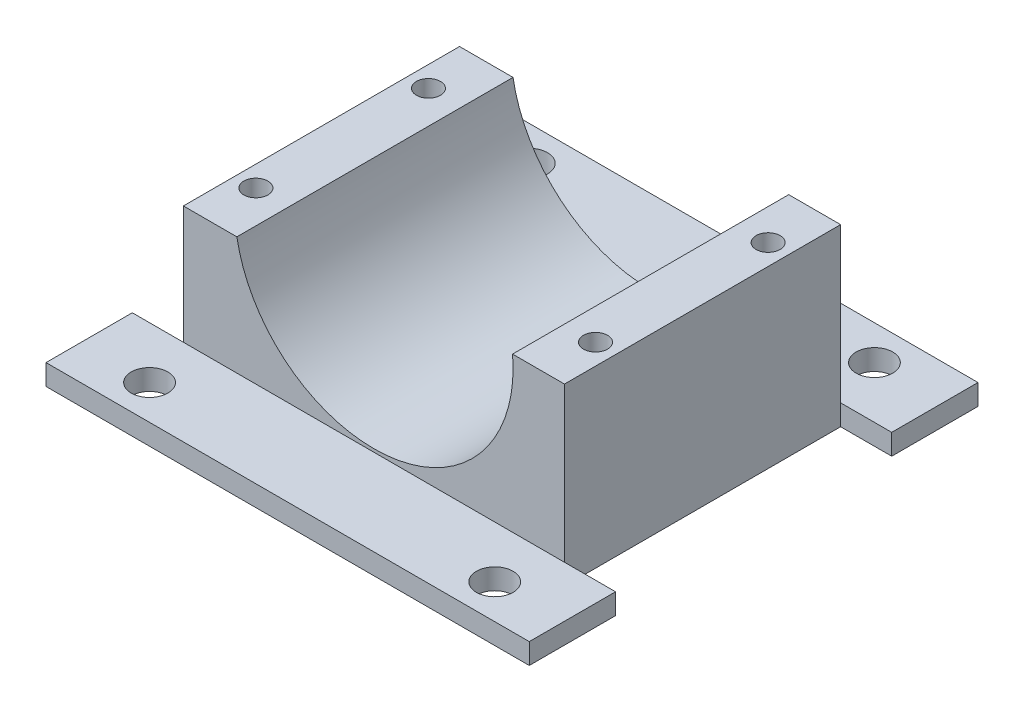
ISO-10303-21;
HEADER;
FILE_DESCRIPTION(('STEP AP214'),'2;1');
FILE_NAME('part.step','',(''),(''),'','','');
FILE_SCHEMA(('AUTOMOTIVE_DESIGN { 1 0 10303 214 1 1 1 1 }'));
ENDSEC;
DATA;
#1=APPLICATION_CONTEXT('core data for automotive mechanical design processes');
#2=APPLICATION_PROTOCOL_DEFINITION('international standard','automotive_design',2000,#1);
#3=PRODUCT_CONTEXT('',#1,'mechanical');
#4=PRODUCT('Part','Part','',(#3));
#5=PRODUCT_RELATED_PRODUCT_CATEGORY('part','',(#4));
#6=PRODUCT_DEFINITION_FORMATION('','',#4);
#7=PRODUCT_DEFINITION_CONTEXT('part definition',#1,'design');
#8=PRODUCT_DEFINITION('design','',#6,#7);
#9=PRODUCT_DEFINITION_SHAPE('','',#8);
#10=(LENGTH_UNIT() NAMED_UNIT(*) SI_UNIT(.MILLI.,.METRE.));
#11=(NAMED_UNIT(*) PLANE_ANGLE_UNIT() SI_UNIT($,.RADIAN.));
#12=(NAMED_UNIT(*) SI_UNIT($,.STERADIAN.) SOLID_ANGLE_UNIT());
#13=UNCERTAINTY_MEASURE_WITH_UNIT(LENGTH_MEASURE(1.E-05),#10,'distance_accuracy_value','');
#14=(GEOMETRIC_REPRESENTATION_CONTEXT(3) GLOBAL_UNCERTAINTY_ASSIGNED_CONTEXT((#13)) GLOBAL_UNIT_ASSIGNED_CONTEXT((#10,
#11,#12)) REPRESENTATION_CONTEXT('',''));
#15=CARTESIAN_POINT('',(0.,0.,0.));
#16=DIRECTION('',(0.,0.,1.));
#17=DIRECTION('',(1.,0.,0.));
#18=AXIS2_PLACEMENT_3D('',#15,#16,#17);
#19=CARTESIAN_POINT('',(0.,0.,-50.8));
#20=DIRECTION('',(0.,0.,1.));
#21=DIRECTION('',(1.,0.,0.));
#22=AXIS2_PLACEMENT_3D('',#19,#20,#21);
#23=PLANE('',#22);
#24=DIRECTION('',(1.,0.,0.));
#25=VECTOR('',#24,1.);
#26=CARTESIAN_POINT('',(-88.9,-52.324,-50.8));
#27=LINE('',#26,#25);
#28=CARTESIAN_POINT('',(-70.104,-52.324,-50.8));
#29=VERTEX_POINT('',#28);
#30=CARTESIAN_POINT('',(70.104,-52.324,-50.8));
#31=VERTEX_POINT('',#30);
#32=EDGE_CURVE('E11',#29,#31,#27,.T.);
#33=ORIENTED_EDGE('',*,*,#32,.F.);
#34=DIRECTION('',(0.,-1.,0.));
#35=VECTOR('',#34,1.);
#36=CARTESIAN_POINT('',(-70.104,0.,-50.8));
#37=LINE('',#36,#35);
#38=CARTESIAN_POINT('',(-70.104,-8.89148128126936,-50.8));
#39=VERTEX_POINT('',#38);
#40=EDGE_CURVE('E285',#39,#29,#37,.T.);
#41=ORIENTED_EDGE('',*,*,#40,.F.);
#42=DIRECTION('',(-1.,0.,0.));
#43=VECTOR('',#42,1.);
#44=CARTESIAN_POINT('',(0.,-8.89148128126934,-50.8));
#45=LINE('',#44,#43);
#46=CARTESIAN_POINT('',(-50.426096139936,-8.89148128126936,-50.8));
#47=VERTEX_POINT('',#46);
#48=EDGE_CURVE('E299',#47,#39,#45,.T.);
#49=ORIENTED_EDGE('',*,*,#48,.F.);
#50=CARTESIAN_POINT('',(0.,0.,-50.8));
#51=DIRECTION('',(0.,0.,1.));
#52=DIRECTION('',(1.,0.,0.));
#53=AXIS2_PLACEMENT_3D('',#50,#51,#52);
#54=CIRCLE('',#53,51.203999954);
#55=CARTESIAN_POINT('',(51.0091532752648,4.46272264764193,-50.8));
#56=VERTEX_POINT('',#55);
#57=EDGE_CURVE('E296',#47,#56,#54,.T.);
#58=ORIENTED_EDGE('',*,*,#57,.T.);
#59=DIRECTION('',(1.,0.,0.));
#60=VECTOR('',#59,1.);
#61=CARTESIAN_POINT('',(0.,4.46272264764193,-50.8));
#62=LINE('',#61,#60);
#63=CARTESIAN_POINT('',(70.104,4.46272264764193,-50.8));
#64=VERTEX_POINT('',#63);
#65=EDGE_CURVE('E293',#56,#64,#62,.T.);
#66=ORIENTED_EDGE('',*,*,#65,.T.);
#67=DIRECTION('',(0.,-1.,0.));
#68=VECTOR('',#67,1.);
#69=CARTESIAN_POINT('',(70.104,0.,-50.8));
#70=LINE('',#69,#68);
#71=EDGE_CURVE('E290',#64,#31,#70,.T.);
#72=ORIENTED_EDGE('',*,*,#71,.T.);
#73=EDGE_LOOP('',(#33,#41,#49,#58,#66,#72));
#74=FACE_BOUND('',#73,.T.);
#75=ADVANCED_FACE('F47',(#74),#23,.F.);
#76=CARTESIAN_POINT('',(0.,0.,50.8));
#77=DIRECTION('',(0.,0.,1.));
#78=DIRECTION('',(1.,0.,0.));
#79=AXIS2_PLACEMENT_3D('',#76,#77,#78);
#80=PLANE('',#79);
#81=DIRECTION('',(0.,-1.,0.));
#82=VECTOR('',#81,1.);
#83=CARTESIAN_POINT('',(-70.104,0.,50.8));
#84=LINE('',#83,#82);
#85=CARTESIAN_POINT('',(-70.104,-8.89148128126936,50.8));
#86=VERTEX_POINT('',#85);
#87=CARTESIAN_POINT('',(-70.104,-52.324,50.8));
#88=VERTEX_POINT('',#87);
#89=EDGE_CURVE('E303',#86,#88,#84,.T.);
#90=ORIENTED_EDGE('',*,*,#89,.T.);
#91=DIRECTION('',(1.,0.,0.));
#92=VECTOR('',#91,1.);
#93=CARTESIAN_POINT('',(-88.9,-52.324,50.8));
#94=LINE('',#93,#92);
#95=CARTESIAN_POINT('',(70.104,-52.324,50.8));
#96=VERTEX_POINT('',#95);
#97=EDGE_CURVE('E57',#88,#96,#94,.T.);
#98=ORIENTED_EDGE('',*,*,#97,.T.);
#99=DIRECTION('',(0.,-1.,0.));
#100=VECTOR('',#99,1.);
#101=CARTESIAN_POINT('',(70.104,0.,50.8));
#102=LINE('',#101,#100);
#103=CARTESIAN_POINT('',(70.104,4.46272264764193,50.8));
#104=VERTEX_POINT('',#103);
#105=EDGE_CURVE('E308',#104,#96,#102,.T.);
#106=ORIENTED_EDGE('',*,*,#105,.F.);
#107=DIRECTION('',(1.,0.,0.));
#108=VECTOR('',#107,1.);
#109=CARTESIAN_POINT('',(0.,4.46272264764193,50.8));
#110=LINE('',#109,#108);
#111=CARTESIAN_POINT('',(51.0091532752648,4.46272264764193,50.8));
#112=VERTEX_POINT('',#111);
#113=EDGE_CURVE('E312',#112,#104,#110,.T.);
#114=ORIENTED_EDGE('',*,*,#113,.F.);
#115=CARTESIAN_POINT('',(0.,0.,50.8));
#116=DIRECTION('',(0.,0.,1.));
#117=DIRECTION('',(1.,0.,0.));
#118=AXIS2_PLACEMENT_3D('',#115,#116,#117);
#119=CIRCLE('',#118,51.203999954);
#120=CARTESIAN_POINT('',(-50.426096139936,-8.89148128126936,50.8));
#121=VERTEX_POINT('',#120);
#122=EDGE_CURVE('E315',#121,#112,#119,.T.);
#123=ORIENTED_EDGE('',*,*,#122,.F.);
#124=DIRECTION('',(-1.,0.,0.));
#125=VECTOR('',#124,1.);
#126=CARTESIAN_POINT('',(0.,-8.89148128126934,50.8));
#127=LINE('',#126,#125);
#128=EDGE_CURVE('E318',#121,#86,#127,.T.);
#129=ORIENTED_EDGE('',*,*,#128,.T.);
#130=EDGE_LOOP('',(#90,#98,#106,#114,#123,#129));
#131=FACE_BOUND('',#130,.T.);
#132=ADVANCED_FACE('F428',(#131),#80,.T.);
#133=CARTESIAN_POINT('',(-70.104,0.,-50.8));
#134=DIRECTION('',(-1.,0.,0.));
#135=DIRECTION('',(0.,0.,1.));
#136=AXIS2_PLACEMENT_3D('',#133,#134,#135);
#137=PLANE('',#136);
#138=ORIENTED_EDGE('',*,*,#89,.F.);
#139=DIRECTION('',(0.,0.,1.));
#140=VECTOR('',#139,1.);
#141=CARTESIAN_POINT('',(-70.104,-8.89148128126936,-50.8));
#142=LINE('',#141,#140);
#143=EDGE_CURVE('E322',#39,#86,#142,.T.);
#144=ORIENTED_EDGE('',*,*,#143,.F.);
#145=ORIENTED_EDGE('',*,*,#40,.T.);
#146=CARTESIAN_POINT('',(-70.104,-59.944,-50.8));
#147=VERTEX_POINT('',#146);
#148=EDGE_CURVE('E289',#29,#147,#37,.T.);
#149=ORIENTED_EDGE('',*,*,#148,.T.);
#150=DIRECTION('',(0.,0.,1.));
#151=VECTOR('',#150,1.);
#152=CARTESIAN_POINT('',(-70.104,-59.944,-50.8));
#153=LINE('',#152,#151);
#154=CARTESIAN_POINT('',(-70.104,-59.944,50.8));
#155=VERTEX_POINT('',#154);
#156=EDGE_CURVE('E51',#147,#155,#153,.T.);
#157=ORIENTED_EDGE('',*,*,#156,.T.);
#158=EDGE_CURVE('E275',#88,#155,#84,.T.);
#159=ORIENTED_EDGE('',*,*,#158,.F.);
#160=EDGE_LOOP('',(#138,#144,#145,#149,#157,#159));
#161=FACE_BOUND('',#160,.T.);
#162=ADVANCED_FACE('F49',(#161),#137,.T.);
#163=CARTESIAN_POINT('',(0.,-8.89148128126934,-50.8));
#164=DIRECTION('',(0.,1.,0.));
#165=DIRECTION('',(-1.,0.,0.));
#166=AXIS2_PLACEMENT_3D('',#163,#164,#165);
#167=PLANE('',#166);
#168=CARTESIAN_POINT('',(-62.484,-8.89148128126934,-31.75));
#169=DIRECTION('',(0.,1.,0.));
#170=DIRECTION('',(0.,0.,1.));
#171=AXIS2_PLACEMENT_3D('',#168,#169,#170);
#172=CIRCLE('',#171,4.4323);
#173=CARTESIAN_POINT('',(-62.484,-8.89148128126934,-27.3177));
#174=VERTEX_POINT('',#173);
#175=EDGE_CURVE('E394',#174,#174,#172,.T.);
#176=ORIENTED_EDGE('',*,*,#175,.F.);
#177=EDGE_LOOP('',(#176));
#178=FACE_BOUND('',#177,.T.);
#179=CARTESIAN_POINT('',(-62.484,-8.89148128126934,31.75));
#180=DIRECTION('',(0.,1.,0.));
#181=DIRECTION('',(0.,0.,1.));
#182=AXIS2_PLACEMENT_3D('',#179,#180,#181);
#183=CIRCLE('',#182,4.4323);
#184=CARTESIAN_POINT('',(-62.484,-8.89148128126934,36.1823));
#185=VERTEX_POINT('',#184);
#186=EDGE_CURVE('E398',#185,#185,#183,.T.);
#187=ORIENTED_EDGE('',*,*,#186,.F.);
#188=EDGE_LOOP('',(#187));
#189=FACE_BOUND('',#188,.T.);
#190=ORIENTED_EDGE('',*,*,#128,.F.);
#191=DIRECTION('',(0.,0.,1.));
#192=VECTOR('',#191,1.);
#193=CARTESIAN_POINT('',(-50.426096139936,-8.89148128126936,-50.8));
#194=LINE('',#193,#192);
#195=EDGE_CURVE('E325',#47,#121,#194,.T.);
#196=ORIENTED_EDGE('',*,*,#195,.F.);
#197=ORIENTED_EDGE('',*,*,#48,.T.);
#198=ORIENTED_EDGE('',*,*,#143,.T.);
#199=EDGE_LOOP('',(#190,#196,#197,#198));
#200=FACE_BOUND('',#199,.T.);
#201=ADVANCED_FACE('F418',(#178,#189,#200),#167,.T.);
#202=CARTESIAN_POINT('',(0.,0.,-50.8));
#203=DIRECTION('',(0.,0.,1.));
#204=DIRECTION('',(1.,0.,0.));
#205=AXIS2_PLACEMENT_3D('',#202,#203,#204);
#206=CYLINDRICAL_SURFACE('',#205,51.203999954);
#207=ORIENTED_EDGE('',*,*,#122,.T.);
#208=DIRECTION('',(0.,0.,1.));
#209=VECTOR('',#208,1.);
#210=CARTESIAN_POINT('',(51.0091532752648,4.46272264764193,-50.8));
#211=LINE('',#210,#209);
#212=EDGE_CURVE('E328',#56,#112,#211,.T.);
#213=ORIENTED_EDGE('',*,*,#212,.F.);
#214=ORIENTED_EDGE('',*,*,#57,.F.);
#215=ORIENTED_EDGE('',*,*,#195,.T.);
#216=EDGE_LOOP('',(#207,#213,#214,#215));
#217=FACE_BOUND('',#216,.T.);
#218=ADVANCED_FACE('F421',(#217),#206,.F.);
#219=CARTESIAN_POINT('',(0.,4.46272264764193,-50.8));
#220=DIRECTION('',(0.,-1.,0.));
#221=DIRECTION('',(0.,0.,-1.));
#222=AXIS2_PLACEMENT_3D('',#219,#220,#221);
#223=PLANE('',#222);
#224=CARTESIAN_POINT('',(62.484,4.46272264764192,-31.75));
#225=DIRECTION('',(0.,1.,0.));
#226=DIRECTION('',(-1.,0.,0.));
#227=AXIS2_PLACEMENT_3D('',#224,#225,#226);
#228=CIRCLE('',#227,4.4323);
#229=CARTESIAN_POINT('',(58.0517,4.46272264764192,-31.75));
#230=VERTEX_POINT('',#229);
#231=EDGE_CURVE('E378',#230,#230,#228,.T.);
#232=ORIENTED_EDGE('',*,*,#231,.F.);
#233=EDGE_LOOP('',(#232));
#234=FACE_BOUND('',#233,.T.);
#235=CARTESIAN_POINT('',(62.484,4.46272264764192,31.75));
#236=DIRECTION('',(0.,1.,0.));
#237=DIRECTION('',(-1.,0.,0.));
#238=AXIS2_PLACEMENT_3D('',#235,#236,#237);
#239=CIRCLE('',#238,4.4323);
#240=CARTESIAN_POINT('',(58.0517,4.46272264764192,31.75));
#241=VERTEX_POINT('',#240);
#242=EDGE_CURVE('E382',#241,#241,#239,.T.);
#243=ORIENTED_EDGE('',*,*,#242,.F.);
#244=EDGE_LOOP('',(#243));
#245=FACE_BOUND('',#244,.T.);
#246=ORIENTED_EDGE('',*,*,#113,.T.);
#247=DIRECTION('',(0.,0.,1.));
#248=VECTOR('',#247,1.);
#249=CARTESIAN_POINT('',(70.104,4.46272264764193,-50.8));
#250=LINE('',#249,#248);
#251=EDGE_CURVE('E332',#64,#104,#250,.T.);
#252=ORIENTED_EDGE('',*,*,#251,.F.);
#253=ORIENTED_EDGE('',*,*,#65,.F.);
#254=ORIENTED_EDGE('',*,*,#212,.T.);
#255=EDGE_LOOP('',(#246,#252,#253,#254));
#256=FACE_BOUND('',#255,.T.);
#257=ADVANCED_FACE('F436',(#234,#245,#256),#223,.F.);
#258=CARTESIAN_POINT('',(70.104,0.,-50.8));
#259=DIRECTION('',(-1.,0.,0.));
#260=DIRECTION('',(0.,-1.,0.));
#261=AXIS2_PLACEMENT_3D('',#258,#259,#260);
#262=PLANE('',#261);
#263=ORIENTED_EDGE('',*,*,#105,.T.);
#264=CARTESIAN_POINT('',(70.104,-59.944,50.8));
#265=VERTEX_POINT('',#264);
#266=EDGE_CURVE('E307',#96,#265,#102,.T.);
#267=ORIENTED_EDGE('',*,*,#266,.T.);
#268=DIRECTION('',(0.,0.,1.));
#269=VECTOR('',#268,1.);
#270=CARTESIAN_POINT('',(70.104,-59.944,-50.8));
#271=LINE('',#270,#269);
#272=CARTESIAN_POINT('',(70.104,-59.944,-50.8));
#273=VERTEX_POINT('',#272);
#274=EDGE_CURVE('E335',#273,#265,#271,.T.);
#275=ORIENTED_EDGE('',*,*,#274,.F.);
#276=EDGE_CURVE('E288',#31,#273,#70,.T.);
#277=ORIENTED_EDGE('',*,*,#276,.F.);
#278=ORIENTED_EDGE('',*,*,#71,.F.);
#279=ORIENTED_EDGE('',*,*,#251,.T.);
#280=EDGE_LOOP('',(#263,#267,#275,#277,#278,#279));
#281=FACE_BOUND('',#280,.T.);
#282=ADVANCED_FACE('F441',(#281),#262,.F.);
#283=CARTESIAN_POINT('',(0.,-59.944,-50.8));
#284=DIRECTION('',(0.,-1.,0.));
#285=DIRECTION('',(0.,0.,-1.));
#286=AXIS2_PLACEMENT_3D('',#283,#284,#285);
#287=PLANE('',#286);
#288=CARTESIAN_POINT('',(-62.484,-59.944,-31.75));
#289=DIRECTION('',(0.,1.,0.));
#290=DIRECTION('',(0.,0.,1.));
#291=AXIS2_PLACEMENT_3D('',#288,#289,#290);
#292=CIRCLE('',#291,4.4323);
#293=CARTESIAN_POINT('',(-62.484,-59.944,-27.3177));
#294=VERTEX_POINT('',#293);
#295=EDGE_CURVE('E390',#294,#294,#292,.T.);
#296=ORIENTED_EDGE('',*,*,#295,.T.);
#297=EDGE_LOOP('',(#296));
#298=FACE_BOUND('',#297,.T.);
#299=CARTESIAN_POINT('',(-62.484,-59.944,31.75));
#300=DIRECTION('',(0.,1.,0.));
#301=DIRECTION('',(0.,0.,1.));
#302=AXIS2_PLACEMENT_3D('',#299,#300,#301);
#303=CIRCLE('',#302,4.4323);
#304=CARTESIAN_POINT('',(-62.484,-59.944,36.1823));
#305=VERTEX_POINT('',#304);
#306=EDGE_CURVE('E402',#305,#305,#303,.T.);
#307=ORIENTED_EDGE('',*,*,#306,.T.);
#308=EDGE_LOOP('',(#307));
#309=FACE_BOUND('',#308,.T.);
#310=CARTESIAN_POINT('',(62.484,-59.944,-31.75));
#311=DIRECTION('',(0.,1.,0.));
#312=DIRECTION('',(-1.,0.,0.));
#313=AXIS2_PLACEMENT_3D('',#310,#311,#312);
#314=CIRCLE('',#313,4.4323);
#315=CARTESIAN_POINT('',(58.0517,-59.944,-31.75));
#316=VERTEX_POINT('',#315);
#317=EDGE_CURVE('E374',#316,#316,#314,.T.);
#318=ORIENTED_EDGE('',*,*,#317,.T.);
#319=EDGE_LOOP('',(#318));
#320=FACE_BOUND('',#319,.T.);
#321=CARTESIAN_POINT('',(62.484,-59.944,31.75));
#322=DIRECTION('',(0.,1.,0.));
#323=DIRECTION('',(-1.,0.,0.));
#324=AXIS2_PLACEMENT_3D('',#321,#322,#323);
#325=CIRCLE('',#324,4.4323);
#326=CARTESIAN_POINT('',(58.0517,-59.944,31.75));
#327=VERTEX_POINT('',#326);
#328=EDGE_CURVE('E386',#327,#327,#325,.T.);
#329=ORIENTED_EDGE('',*,*,#328,.T.);
#330=EDGE_LOOP('',(#329));
#331=FACE_BOUND('',#330,.T.);
#332=CARTESIAN_POINT('',(-63.5,-59.944,-69.85));
#333=DIRECTION('',(0.,1.,0.));
#334=DIRECTION('',(0.,0.,1.));
#335=AXIS2_PLACEMENT_3D('',#332,#333,#334);
#336=CIRCLE('',#335,6.74624);
#337=CARTESIAN_POINT('',(-63.5,-59.944,-63.10376));
#338=VERTEX_POINT('',#337);
#339=EDGE_CURVE('E367',#338,#338,#336,.T.);
#340=ORIENTED_EDGE('',*,*,#339,.T.);
#341=EDGE_LOOP('',(#340));
#342=FACE_BOUND('',#341,.T.);
#343=CARTESIAN_POINT('',(63.5,-59.944,-69.85));
#344=DIRECTION('',(0.,1.,0.));
#345=DIRECTION('',(0.,0.,1.));
#346=AXIS2_PLACEMENT_3D('',#343,#344,#345);
#347=CIRCLE('',#346,6.74624);
#348=CARTESIAN_POINT('',(63.5,-59.944,-63.10376));
#349=VERTEX_POINT('',#348);
#350=EDGE_CURVE('E200',#349,#349,#347,.T.);
#351=ORIENTED_EDGE('',*,*,#350,.T.);
#352=EDGE_LOOP('',(#351));
#353=FACE_BOUND('',#352,.T.);
#354=CARTESIAN_POINT('',(-63.5,-59.944,69.85));
#355=DIRECTION('',(0.,1.,0.));
#356=DIRECTION('',(0.,0.,1.));
#357=AXIS2_PLACEMENT_3D('',#354,#355,#356);
#358=CIRCLE('',#357,6.74624);
#359=CARTESIAN_POINT('',(-63.5,-59.944,76.59624));
#360=VERTEX_POINT('',#359);
#361=EDGE_CURVE('E226',#360,#360,#358,.T.);
#362=ORIENTED_EDGE('',*,*,#361,.T.);
#363=EDGE_LOOP('',(#362));
#364=FACE_BOUND('',#363,.T.);
#365=CARTESIAN_POINT('',(63.5,-59.944,69.85));
#366=DIRECTION('',(0.,1.,0.));
#367=DIRECTION('',(0.,0.,1.));
#368=AXIS2_PLACEMENT_3D('',#365,#366,#367);
#369=CIRCLE('',#368,6.74624);
#370=CARTESIAN_POINT('',(63.5,-59.944,76.59624));
#371=VERTEX_POINT('',#370);
#372=EDGE_CURVE('E234',#371,#371,#369,.T.);
#373=ORIENTED_EDGE('',*,*,#372,.T.);
#374=EDGE_LOOP('',(#373));
#375=FACE_BOUND('',#374,.T.);
#376=ORIENTED_EDGE('',*,*,#274,.T.);
#377=DIRECTION('',(1.,0.,0.));
#378=VECTOR('',#377,1.);
#379=CARTESIAN_POINT('',(-88.9,-59.944,50.8));
#380=LINE('',#379,#378);
#381=CARTESIAN_POINT('',(88.9,-59.944,50.8));
#382=VERTEX_POINT('',#381);
#383=EDGE_CURVE('E260',#265,#382,#380,.T.);
#384=ORIENTED_EDGE('',*,*,#383,.T.);
#385=DIRECTION('',(0.,0.,1.));
#386=VECTOR('',#385,1.);
#387=CARTESIAN_POINT('',(88.9,-59.944,82.55));
#388=LINE('',#387,#386);
#389=CARTESIAN_POINT('',(88.9,-59.944,82.55));
#390=VERTEX_POINT('',#389);
#391=EDGE_CURVE('E265',#382,#390,#388,.T.);
#392=ORIENTED_EDGE('',*,*,#391,.T.);
#393=DIRECTION('',(-1.,0.,0.));
#394=VECTOR('',#393,1.);
#395=CARTESIAN_POINT('',(-88.9,-59.944,82.55));
#396=LINE('',#395,#394);
#397=CARTESIAN_POINT('',(-88.9,-59.944,82.55));
#398=VERTEX_POINT('',#397);
#399=EDGE_CURVE('E243',#390,#398,#396,.T.);
#400=ORIENTED_EDGE('',*,*,#399,.T.);
#401=DIRECTION('',(0.,0.,-1.));
#402=VECTOR('',#401,1.);
#403=CARTESIAN_POINT('',(-88.9,-59.944,82.55));
#404=LINE('',#403,#402);
#405=CARTESIAN_POINT('',(-88.9,-59.944,50.8));
#406=VERTEX_POINT('',#405);
#407=EDGE_CURVE('E238',#398,#406,#404,.T.);
#408=ORIENTED_EDGE('',*,*,#407,.T.);
#409=EDGE_CURVE('E261',#406,#155,#380,.T.);
#410=ORIENTED_EDGE('',*,*,#409,.T.);
#411=ORIENTED_EDGE('',*,*,#156,.F.);
#412=DIRECTION('',(1.,0.,0.));
#413=VECTOR('',#412,1.);
#414=CARTESIAN_POINT('',(-88.9,-59.944,-50.8));
#415=LINE('',#414,#413);
#416=CARTESIAN_POINT('',(-88.9,-59.944,-50.8));
#417=VERTEX_POINT('',#416);
#418=EDGE_CURVE('E193',#417,#147,#415,.T.);
#419=ORIENTED_EDGE('',*,*,#418,.F.);
#420=DIRECTION('',(0.,0.,1.));
#421=VECTOR('',#420,1.);
#422=CARTESIAN_POINT('',(-88.9,-59.944,-82.55));
#423=LINE('',#422,#421);
#424=CARTESIAN_POINT('',(-88.9,-59.944,-82.55));
#425=VERTEX_POINT('',#424);
#426=EDGE_CURVE('E206',#425,#417,#423,.T.);
#427=ORIENTED_EDGE('',*,*,#426,.F.);
#428=DIRECTION('',(-1.,0.,0.));
#429=VECTOR('',#428,1.);
#430=CARTESIAN_POINT('',(-88.9,-59.944,-82.55));
#431=LINE('',#430,#429);
#432=CARTESIAN_POINT('',(88.9,-59.944,-82.55));
#433=VERTEX_POINT('',#432);
#434=EDGE_CURVE('E182',#433,#425,#431,.T.);
#435=ORIENTED_EDGE('',*,*,#434,.F.);
#436=DIRECTION('',(0.,0.,-1.));
#437=VECTOR('',#436,1.);
#438=CARTESIAN_POINT('',(88.9,-59.944,-82.55));
#439=LINE('',#438,#437);
#440=CARTESIAN_POINT('',(88.9,-59.944,-50.8));
#441=VERTEX_POINT('',#440);
#442=EDGE_CURVE('E211',#441,#433,#439,.T.);
#443=ORIENTED_EDGE('',*,*,#442,.F.);
#444=EDGE_CURVE('E197',#273,#441,#415,.T.);
#445=ORIENTED_EDGE('',*,*,#444,.F.);
#446=EDGE_LOOP('',(#376,#384,#392,#400,#408,#410,#411,#419,#427,#435,#443,#445));
#447=FACE_BOUND('',#446,.T.);
#448=ADVANCED_FACE('F347',(#298,#309,#320,#331,#342,#353,#364,#375,#447),#287,.T.);
#449=CARTESIAN_POINT('',(-88.9,-52.324,50.8));
#450=DIRECTION('',(0.,0.,-1.));
#451=DIRECTION('',(-1.,0.,0.));
#452=AXIS2_PLACEMENT_3D('',#449,#450,#451);
#453=PLANE('',#452);
#454=ORIENTED_EDGE('',*,*,#266,.F.);
#455=CARTESIAN_POINT('',(88.9,-52.324,50.8));
#456=VERTEX_POINT('',#455);
#457=EDGE_CURVE('E73',#96,#456,#94,.T.);
#458=ORIENTED_EDGE('',*,*,#457,.T.);
#459=DIRECTION('',(0.,-1.,0.));
#460=VECTOR('',#459,1.);
#461=CARTESIAN_POINT('',(88.9,-52.324,50.8));
#462=LINE('',#461,#460);
#463=EDGE_CURVE('E279',#456,#382,#462,.T.);
#464=ORIENTED_EDGE('',*,*,#463,.T.);
#465=ORIENTED_EDGE('',*,*,#383,.F.);
#466=EDGE_LOOP('',(#454,#458,#464,#465));
#467=FACE_BOUND('',#466,.T.);
#468=ADVANCED_FACE('F454',(#467),#453,.T.);
#469=CARTESIAN_POINT('',(-88.9,-52.324,82.55));
#470=DIRECTION('',(-1.,0.,0.));
#471=DIRECTION('',(0.,0.,1.));
#472=AXIS2_PLACEMENT_3D('',#469,#470,#471);
#473=PLANE('',#472);
#474=ORIENTED_EDGE('',*,*,#407,.F.);
#475=DIRECTION('',(0.,-1.,0.));
#476=VECTOR('',#475,1.);
#477=CARTESIAN_POINT('',(-88.9,-52.324,82.55));
#478=LINE('',#477,#476);
#479=CARTESIAN_POINT('',(-88.9,-52.324,82.55));
#480=VERTEX_POINT('',#479);
#481=EDGE_CURVE('E272',#480,#398,#478,.T.);
#482=ORIENTED_EDGE('',*,*,#481,.F.);
#483=DIRECTION('',(0.,0.,-1.));
#484=VECTOR('',#483,1.);
#485=CARTESIAN_POINT('',(-88.9,-52.324,82.55));
#486=LINE('',#485,#484);
#487=CARTESIAN_POINT('',(-88.9,-52.324,50.8));
#488=VERTEX_POINT('',#487);
#489=EDGE_CURVE('E239',#480,#488,#486,.T.);
#490=ORIENTED_EDGE('',*,*,#489,.T.);
#491=DIRECTION('',(0.,-1.,0.));
#492=VECTOR('',#491,1.);
#493=CARTESIAN_POINT('',(-88.9,-52.324,50.8));
#494=LINE('',#493,#492);
#495=EDGE_CURVE('E256',#488,#406,#494,.T.);
#496=ORIENTED_EDGE('',*,*,#495,.T.);
#497=EDGE_LOOP('',(#474,#482,#490,#496));
#498=FACE_BOUND('',#497,.T.);
#499=ADVANCED_FACE('F462',(#498),#473,.T.);
#500=CARTESIAN_POINT('',(-88.9,-52.324,82.55));
#501=DIRECTION('',(0.,0.,1.));
#502=DIRECTION('',(1.,0.,0.));
#503=AXIS2_PLACEMENT_3D('',#500,#501,#502);
#504=PLANE('',#503);
#505=ORIENTED_EDGE('',*,*,#399,.F.);
#506=DIRECTION('',(0.,-1.,0.));
#507=VECTOR('',#506,1.);
#508=CARTESIAN_POINT('',(88.9,-52.324,82.55));
#509=LINE('',#508,#507);
#510=CARTESIAN_POINT('',(88.9,-52.324,82.55));
#511=VERTEX_POINT('',#510);
#512=EDGE_CURVE('E276',#511,#390,#509,.T.);
#513=ORIENTED_EDGE('',*,*,#512,.F.);
#514=DIRECTION('',(-1.,0.,0.));
#515=VECTOR('',#514,1.);
#516=CARTESIAN_POINT('',(-88.9,-52.324,82.55));
#517=LINE('',#516,#515);
#518=EDGE_CURVE('E252',#511,#480,#517,.T.);
#519=ORIENTED_EDGE('',*,*,#518,.T.);
#520=ORIENTED_EDGE('',*,*,#481,.T.);
#521=EDGE_LOOP('',(#505,#513,#519,#520));
#522=FACE_BOUND('',#521,.T.);
#523=ADVANCED_FACE('F459',(#522),#504,.T.);
#524=CARTESIAN_POINT('',(88.9,-52.324,82.55));
#525=DIRECTION('',(1.,0.,0.));
#526=DIRECTION('',(0.,0.,-1.));
#527=AXIS2_PLACEMENT_3D('',#524,#525,#526);
#528=PLANE('',#527);
#529=ORIENTED_EDGE('',*,*,#391,.F.);
#530=ORIENTED_EDGE('',*,*,#463,.F.);
#531=DIRECTION('',(0.,0.,1.));
#532=VECTOR('',#531,1.);
#533=CARTESIAN_POINT('',(88.9,-52.324,82.55));
#534=LINE('',#533,#532);
#535=EDGE_CURVE('E248',#456,#511,#534,.T.);
#536=ORIENTED_EDGE('',*,*,#535,.T.);
#537=ORIENTED_EDGE('',*,*,#512,.T.);
#538=EDGE_LOOP('',(#529,#530,#536,#537));
#539=FACE_BOUND('',#538,.T.);
#540=ADVANCED_FACE('F456',(#539),#528,.T.);
#541=EDGE_CURVE('E244',#488,#88,#94,.T.);
#542=ORIENTED_EDGE('',*,*,#541,.T.);
#543=ORIENTED_EDGE('',*,*,#158,.T.);
#544=ORIENTED_EDGE('',*,*,#409,.F.);
#545=ORIENTED_EDGE('',*,*,#495,.F.);
#546=EDGE_LOOP('',(#542,#543,#544,#545));
#547=FACE_BOUND('',#546,.T.);
#548=ADVANCED_FACE('F466',(#547),#453,.T.);
#549=CARTESIAN_POINT('',(0.,-52.324,0.));
#550=DIRECTION('',(0.,-1.,0.));
#551=DIRECTION('',(0.,0.,-1.));
#552=AXIS2_PLACEMENT_3D('',#549,#550,#551);
#553=PLANE('',#552);
#554=CARTESIAN_POINT('',(-63.5,-52.324,69.85));
#555=DIRECTION('',(0.,1.,0.));
#556=DIRECTION('',(0.,0.,1.));
#557=AXIS2_PLACEMENT_3D('',#554,#555,#556);
#558=CIRCLE('',#557,6.74623999999999);
#559=CARTESIAN_POINT('',(-63.5,-52.324,76.59624));
#560=VERTEX_POINT('',#559);
#561=EDGE_CURVE('E216',#560,#560,#558,.T.);
#562=ORIENTED_EDGE('',*,*,#561,.F.);
#563=EDGE_LOOP('',(#562));
#564=FACE_BOUND('',#563,.T.);
#565=CARTESIAN_POINT('',(63.5,-52.324,69.85));
#566=DIRECTION('',(0.,1.,0.));
#567=DIRECTION('',(0.,0.,1.));
#568=AXIS2_PLACEMENT_3D('',#565,#566,#567);
#569=CIRCLE('',#568,6.74623999999999);
#570=CARTESIAN_POINT('',(63.5,-52.324,76.59624));
#571=VERTEX_POINT('',#570);
#572=EDGE_CURVE('E230',#571,#571,#569,.T.);
#573=ORIENTED_EDGE('',*,*,#572,.F.);
#574=EDGE_LOOP('',(#573));
#575=FACE_BOUND('',#574,.T.);
#576=ORIENTED_EDGE('',*,*,#489,.F.);
#577=ORIENTED_EDGE('',*,*,#518,.F.);
#578=ORIENTED_EDGE('',*,*,#535,.F.);
#579=ORIENTED_EDGE('',*,*,#457,.F.);
#580=ORIENTED_EDGE('',*,*,#97,.F.);
#581=ORIENTED_EDGE('',*,*,#541,.F.);
#582=EDGE_LOOP('',(#576,#577,#578,#579,#580,#581));
#583=FACE_BOUND('',#582,.T.);
#584=ADVANCED_FACE('F467',(#564,#575,#583),#553,.F.);
#585=CARTESIAN_POINT('',(63.5,-52.324,69.85));
#586=DIRECTION('',(0.,1.,0.));
#587=DIRECTION('',(0.,0.,1.));
#588=AXIS2_PLACEMENT_3D('',#585,#586,#587);
#589=CYLINDRICAL_SURFACE('',#588,6.74623999999999);
#590=ORIENTED_EDGE('',*,*,#372,.F.);
#591=EDGE_LOOP('',(#590));
#592=FACE_BOUND('',#591,.T.);
#593=ORIENTED_EDGE('',*,*,#572,.T.);
#594=EDGE_LOOP('',(#593));
#595=FACE_BOUND('',#594,.T.);
#596=ADVANCED_FACE('F470',(#592,#595),#589,.F.);
#597=CARTESIAN_POINT('',(-63.5,-52.324,69.85));
#598=DIRECTION('',(0.,1.,0.));
#599=DIRECTION('',(0.,0.,1.));
#600=AXIS2_PLACEMENT_3D('',#597,#598,#599);
#601=CYLINDRICAL_SURFACE('',#600,6.74623999999999);
#602=ORIENTED_EDGE('',*,*,#361,.F.);
#603=EDGE_LOOP('',(#602));
#604=FACE_BOUND('',#603,.T.);
#605=ORIENTED_EDGE('',*,*,#561,.T.);
#606=EDGE_LOOP('',(#605));
#607=FACE_BOUND('',#606,.T.);
#608=ADVANCED_FACE('F477',(#604,#607),#601,.F.);
#609=CARTESIAN_POINT('',(-88.9,-52.324,-50.8));
#610=DIRECTION('',(0.,0.,-1.));
#611=DIRECTION('',(-1.,0.,0.));
#612=AXIS2_PLACEMENT_3D('',#609,#610,#611);
#613=PLANE('',#612);
#614=CARTESIAN_POINT('',(88.9,-52.324,-50.8));
#615=VERTEX_POINT('',#614);
#616=EDGE_CURVE('E60',#31,#615,#27,.T.);
#617=ORIENTED_EDGE('',*,*,#616,.F.);
#618=ORIENTED_EDGE('',*,*,#276,.T.);
#619=ORIENTED_EDGE('',*,*,#444,.T.);
#620=DIRECTION('',(0.,-1.,0.));
#621=VECTOR('',#620,1.);
#622=CARTESIAN_POINT('',(88.9,-52.324,-50.8));
#623=LINE('',#622,#621);
#624=EDGE_CURVE('E217',#615,#441,#623,.T.);
#625=ORIENTED_EDGE('',*,*,#624,.F.);
#626=EDGE_LOOP('',(#617,#618,#619,#625));
#627=FACE_BOUND('',#626,.T.);
#628=ADVANCED_FACE('F357',(#627),#613,.F.);
#629=CARTESIAN_POINT('',(-88.9,-52.324,-82.55));
#630=DIRECTION('',(1.,0.,0.));
#631=DIRECTION('',(0.,0.,-1.));
#632=AXIS2_PLACEMENT_3D('',#629,#630,#631);
#633=PLANE('',#632);
#634=ORIENTED_EDGE('',*,*,#426,.T.);
#635=DIRECTION('',(0.,-1.,0.));
#636=VECTOR('',#635,1.);
#637=CARTESIAN_POINT('',(-88.9,-52.324,-50.8));
#638=LINE('',#637,#636);
#639=CARTESIAN_POINT('',(-88.9,-52.324,-50.8));
#640=VERTEX_POINT('',#639);
#641=EDGE_CURVE('E191',#640,#417,#638,.T.);
#642=ORIENTED_EDGE('',*,*,#641,.F.);
#643=DIRECTION('',(0.,0.,1.));
#644=VECTOR('',#643,1.);
#645=CARTESIAN_POINT('',(-88.9,-52.324,-82.55));
#646=LINE('',#645,#644);
#647=CARTESIAN_POINT('',(-88.9,-52.324,-82.55));
#648=VERTEX_POINT('',#647);
#649=EDGE_CURVE('E169',#648,#640,#646,.T.);
#650=ORIENTED_EDGE('',*,*,#649,.F.);
#651=DIRECTION('',(0.,-1.,0.));
#652=VECTOR('',#651,1.);
#653=CARTESIAN_POINT('',(-88.9,-52.324,-82.55));
#654=LINE('',#653,#652);
#655=EDGE_CURVE('E179',#648,#425,#654,.T.);
#656=ORIENTED_EDGE('',*,*,#655,.T.);
#657=EDGE_LOOP('',(#634,#642,#650,#656));
#658=FACE_BOUND('',#657,.T.);
#659=ADVANCED_FACE('F189',(#658),#633,.F.);
#660=ORIENTED_EDGE('',*,*,#148,.F.);
#661=EDGE_CURVE('E59',#640,#29,#27,.T.);
#662=ORIENTED_EDGE('',*,*,#661,.F.);
#663=ORIENTED_EDGE('',*,*,#641,.T.);
#664=ORIENTED_EDGE('',*,*,#418,.T.);
#665=EDGE_LOOP('',(#660,#662,#663,#664));
#666=FACE_BOUND('',#665,.T.);
#667=ADVANCED_FACE('F350',(#666),#613,.F.);
#668=CARTESIAN_POINT('',(88.9,-52.324,-82.55));
#669=DIRECTION('',(-1.,0.,0.));
#670=DIRECTION('',(0.,0.,1.));
#671=AXIS2_PLACEMENT_3D('',#668,#669,#670);
#672=PLANE('',#671);
#673=ORIENTED_EDGE('',*,*,#442,.T.);
#674=DIRECTION('',(0.,-1.,0.));
#675=VECTOR('',#674,1.);
#676=CARTESIAN_POINT('',(88.9,-52.324,-82.55));
#677=LINE('',#676,#675);
#678=CARTESIAN_POINT('',(88.9,-52.324,-82.55));
#679=VERTEX_POINT('',#678);
#680=EDGE_CURVE('E187',#679,#433,#677,.T.);
#681=ORIENTED_EDGE('',*,*,#680,.F.);
#682=DIRECTION('',(0.,0.,-1.));
#683=VECTOR('',#682,1.);
#684=CARTESIAN_POINT('',(88.9,-52.324,-82.55));
#685=LINE('',#684,#683);
#686=EDGE_CURVE('E172',#615,#679,#685,.T.);
#687=ORIENTED_EDGE('',*,*,#686,.F.);
#688=ORIENTED_EDGE('',*,*,#624,.T.);
#689=EDGE_LOOP('',(#673,#681,#687,#688));
#690=FACE_BOUND('',#689,.T.);
#691=ADVANCED_FACE('F353',(#690),#672,.F.);
#692=CARTESIAN_POINT('',(-88.9,-52.324,-82.55));
#693=DIRECTION('',(0.,0.,1.));
#694=DIRECTION('',(1.,0.,0.));
#695=AXIS2_PLACEMENT_3D('',#692,#693,#694);
#696=PLANE('',#695);
#697=ORIENTED_EDGE('',*,*,#434,.T.);
#698=ORIENTED_EDGE('',*,*,#655,.F.);
#699=DIRECTION('',(-1.,0.,0.));
#700=VECTOR('',#699,1.);
#701=CARTESIAN_POINT('',(-88.9,-52.324,-82.55));
#702=LINE('',#701,#700);
#703=EDGE_CURVE('E164',#679,#648,#702,.T.);
#704=ORIENTED_EDGE('',*,*,#703,.F.);
#705=ORIENTED_EDGE('',*,*,#680,.T.);
#706=EDGE_LOOP('',(#697,#698,#704,#705));
#707=FACE_BOUND('',#706,.T.);
#708=ADVANCED_FACE('F180',(#707),#696,.F.);
#709=CARTESIAN_POINT('',(0.,-52.324,0.));
#710=DIRECTION('',(0.,-1.,0.));
#711=DIRECTION('',(0.,0.,1.));
#712=AXIS2_PLACEMENT_3D('',#709,#710,#711);
#713=PLANE('',#712);
#714=CARTESIAN_POINT('',(-63.5,-52.324,-69.85));
#715=DIRECTION('',(0.,1.,0.));
#716=DIRECTION('',(0.,0.,1.));
#717=AXIS2_PLACEMENT_3D('',#714,#715,#716);
#718=CIRCLE('',#717,6.74623999999999);
#719=CARTESIAN_POINT('',(-63.5,-52.324,-63.10376));
#720=VERTEX_POINT('',#719);
#721=EDGE_CURVE('E370',#720,#720,#718,.T.);
#722=ORIENTED_EDGE('',*,*,#721,.F.);
#723=EDGE_LOOP('',(#722));
#724=FACE_BOUND('',#723,.T.);
#725=CARTESIAN_POINT('',(63.5,-52.324,-69.85));
#726=DIRECTION('',(0.,1.,0.));
#727=DIRECTION('',(0.,0.,1.));
#728=AXIS2_PLACEMENT_3D('',#725,#726,#727);
#729=CIRCLE('',#728,6.74623999999999);
#730=CARTESIAN_POINT('',(63.5,-52.324,-63.10376));
#731=VERTEX_POINT('',#730);
#732=EDGE_CURVE('E364',#731,#731,#729,.T.);
#733=ORIENTED_EDGE('',*,*,#732,.F.);
#734=EDGE_LOOP('',(#733));
#735=FACE_BOUND('',#734,.T.);
#736=ORIENTED_EDGE('',*,*,#649,.T.);
#737=ORIENTED_EDGE('',*,*,#661,.T.);
#738=ORIENTED_EDGE('',*,*,#32,.T.);
#739=ORIENTED_EDGE('',*,*,#616,.T.);
#740=ORIENTED_EDGE('',*,*,#686,.T.);
#741=ORIENTED_EDGE('',*,*,#703,.T.);
#742=EDGE_LOOP('',(#736,#737,#738,#739,#740,#741));
#743=FACE_BOUND('',#742,.T.);
#744=ADVANCED_FACE('F166',(#724,#735,#743),#713,.F.);
#745=CARTESIAN_POINT('',(63.5,-52.324,-69.85));
#746=DIRECTION('',(0.,1.,0.));
#747=DIRECTION('',(0.,0.,1.));
#748=AXIS2_PLACEMENT_3D('',#745,#746,#747);
#749=CYLINDRICAL_SURFACE('',#748,6.74623999999999);
#750=ORIENTED_EDGE('',*,*,#350,.F.);
#751=EDGE_LOOP('',(#750));
#752=FACE_BOUND('',#751,.T.);
#753=ORIENTED_EDGE('',*,*,#732,.T.);
#754=EDGE_LOOP('',(#753));
#755=FACE_BOUND('',#754,.T.);
#756=ADVANCED_FACE('F524',(#752,#755),#749,.F.);
#757=CARTESIAN_POINT('',(-63.5,-52.324,-69.85));
#758=DIRECTION('',(0.,1.,0.));
#759=DIRECTION('',(0.,0.,1.));
#760=AXIS2_PLACEMENT_3D('',#757,#758,#759);
#761=CYLINDRICAL_SURFACE('',#760,6.74623999999999);
#762=ORIENTED_EDGE('',*,*,#339,.F.);
#763=EDGE_LOOP('',(#762));
#764=FACE_BOUND('',#763,.T.);
#765=ORIENTED_EDGE('',*,*,#721,.T.);
#766=EDGE_LOOP('',(#765));
#767=FACE_BOUND('',#766,.T.);
#768=ADVANCED_FACE('F520',(#764,#767),#761,.F.);
#769=CARTESIAN_POINT('',(62.484,-59.944,31.75));
#770=DIRECTION('',(0.,1.,0.));
#771=DIRECTION('',(-1.,0.,0.));
#772=AXIS2_PLACEMENT_3D('',#769,#770,#771);
#773=CYLINDRICAL_SURFACE('',#772,4.4323);
#774=ORIENTED_EDGE('',*,*,#328,.F.);
#775=EDGE_LOOP('',(#774));
#776=FACE_BOUND('',#775,.T.);
#777=ORIENTED_EDGE('',*,*,#242,.T.);
#778=EDGE_LOOP('',(#777));
#779=FACE_BOUND('',#778,.T.);
#780=ADVANCED_FACE('F516',(#776,#779),#773,.F.);
#781=CARTESIAN_POINT('',(62.484,-59.944,-31.75));
#782=DIRECTION('',(0.,1.,0.));
#783=DIRECTION('',(-1.,0.,0.));
#784=AXIS2_PLACEMENT_3D('',#781,#782,#783);
#785=CYLINDRICAL_SURFACE('',#784,4.4323);
#786=ORIENTED_EDGE('',*,*,#317,.F.);
#787=EDGE_LOOP('',(#786));
#788=FACE_BOUND('',#787,.T.);
#789=ORIENTED_EDGE('',*,*,#231,.T.);
#790=EDGE_LOOP('',(#789));
#791=FACE_BOUND('',#790,.T.);
#792=ADVANCED_FACE('F414',(#788,#791),#785,.F.);
#793=CARTESIAN_POINT('',(-62.484,-59.944,31.75));
#794=DIRECTION('',(0.,1.,0.));
#795=DIRECTION('',(0.,0.,1.));
#796=AXIS2_PLACEMENT_3D('',#793,#794,#795);
#797=CYLINDRICAL_SURFACE('',#796,4.4323);
#798=ORIENTED_EDGE('',*,*,#306,.F.);
#799=EDGE_LOOP('',(#798));
#800=FACE_BOUND('',#799,.T.);
#801=ORIENTED_EDGE('',*,*,#186,.T.);
#802=EDGE_LOOP('',(#801));
#803=FACE_BOUND('',#802,.T.);
#804=ADVANCED_FACE('F410',(#800,#803),#797,.F.);
#805=CARTESIAN_POINT('',(-62.484,-59.944,-31.75));
#806=DIRECTION('',(0.,1.,0.));
#807=DIRECTION('',(0.,0.,1.));
#808=AXIS2_PLACEMENT_3D('',#805,#806,#807);
#809=CYLINDRICAL_SURFACE('',#808,4.4323);
#810=ORIENTED_EDGE('',*,*,#295,.F.);
#811=EDGE_LOOP('',(#810));
#812=FACE_BOUND('',#811,.T.);
#813=ORIENTED_EDGE('',*,*,#175,.T.);
#814=EDGE_LOOP('',(#813));
#815=FACE_BOUND('',#814,.T.);
#816=ADVANCED_FACE('F413',(#812,#815),#809,.F.);
#817=CLOSED_SHELL('',(#75,#132,#162,#201,#218,#257,#282,#448,#468,#499,#523,#540,#548,#584,#596,
#608,#628,#659,#667,#691,#708,#744,#756,#768,#780,#792,#804,#816));
#818=MANIFOLD_SOLID_BREP('B2',#817);
#819=ADVANCED_BREP_SHAPE_REPRESENTATION('',(#18,#818),#14);
#820=SHAPE_DEFINITION_REPRESENTATION(#9,#819);
ENDSEC;
END-ISO-10303-21;
